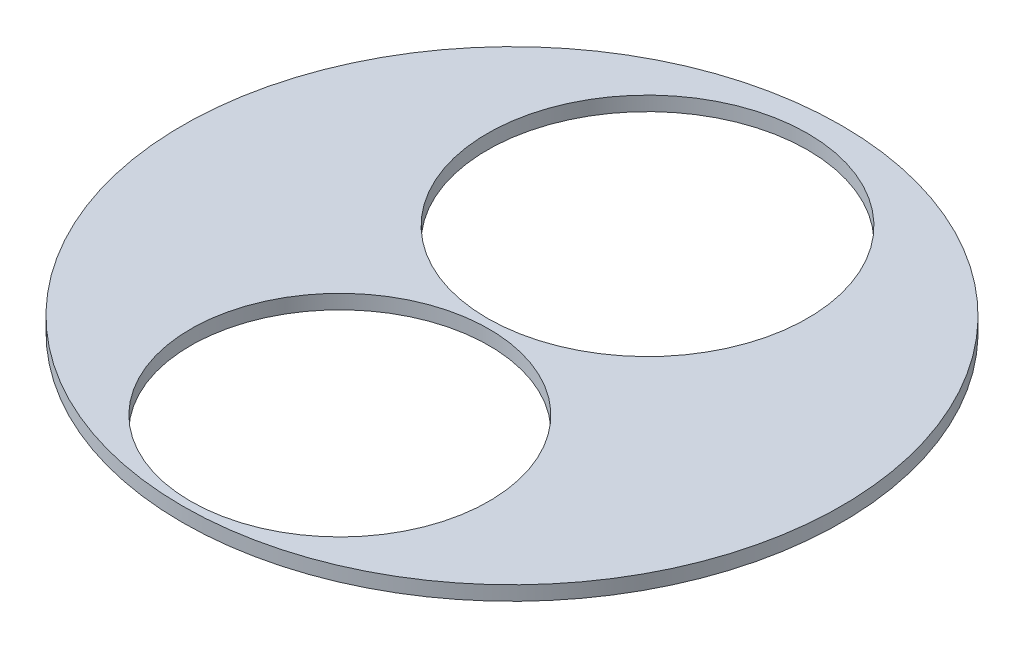
ISO-10303-21;
HEADER;
FILE_DESCRIPTION(('STEP AP214'),'2;1');
FILE_NAME('part.step','',(''),(''),'','','');
FILE_SCHEMA(('AUTOMOTIVE_DESIGN { 1 0 10303 214 1 1 1 1 }'));
ENDSEC;
DATA;
#1=APPLICATION_CONTEXT('core data for automotive mechanical design processes');
#2=APPLICATION_PROTOCOL_DEFINITION('international standard','automotive_design',2000,#1);
#3=PRODUCT_CONTEXT('',#1,'mechanical');
#4=PRODUCT('Part','Part','',(#3));
#5=PRODUCT_RELATED_PRODUCT_CATEGORY('part','',(#4));
#6=PRODUCT_DEFINITION_FORMATION('','',#4);
#7=PRODUCT_DEFINITION_CONTEXT('part definition',#1,'design');
#8=PRODUCT_DEFINITION('design','',#6,#7);
#9=PRODUCT_DEFINITION_SHAPE('','',#8);
#10=(LENGTH_UNIT() NAMED_UNIT(*) SI_UNIT(.MILLI.,.METRE.));
#11=(NAMED_UNIT(*) PLANE_ANGLE_UNIT() SI_UNIT($,.RADIAN.));
#12=(NAMED_UNIT(*) SI_UNIT($,.STERADIAN.) SOLID_ANGLE_UNIT());
#13=UNCERTAINTY_MEASURE_WITH_UNIT(LENGTH_MEASURE(1.E-05),#10,'distance_accuracy_value','');
#14=(GEOMETRIC_REPRESENTATION_CONTEXT(3) GLOBAL_UNCERTAINTY_ASSIGNED_CONTEXT((#13)) GLOBAL_UNIT_ASSIGNED_CONTEXT((#10,
#11,#12)) REPRESENTATION_CONTEXT('',''));
#15=CARTESIAN_POINT('',(0.,0.,0.));
#16=DIRECTION('',(0.,0.,1.));
#17=DIRECTION('',(1.,0.,0.));
#18=AXIS2_PLACEMENT_3D('',#15,#16,#17);
#19=CARTESIAN_POINT('',(0.,50.,0.));
#20=DIRECTION('',(0.,1.,0.));
#21=DIRECTION('',(0.,0.,1.));
#22=AXIS2_PLACEMENT_3D('',#19,#20,#21);
#23=PLANE('',#22);
#24=CARTESIAN_POINT('',(-35.2158294782896,50.,-508.071242416975));
#25=DIRECTION('',(0.,1.,0.));
#26=DIRECTION('',(0.,0.,1.));
#27=AXIS2_PLACEMENT_3D('',#24,#25,#26);
#28=CIRCLE('',#27,558.8);
#29=CARTESIAN_POINT('',(-35.2158294782896,50.,50.7287575830254));
#30=VERTEX_POINT('',#29);
#31=EDGE_CURVE('E54',#30,#30,#28,.T.);
#32=ORIENTED_EDGE('',*,*,#31,.F.);
#33=EDGE_LOOP('',(#32));
#34=FACE_BOUND('',#33,.T.);
#35=CARTESIAN_POINT('',(0.,50.,0.));
#36=DIRECTION('',(0.,1.,0.));
#37=DIRECTION('',(0.,0.,1.));
#38=AXIS2_PLACEMENT_3D('',#35,#36,#37);
#39=CIRCLE('',#38,1149.985);
#40=CARTESIAN_POINT('',(0.,50.,1149.985));
#41=VERTEX_POINT('',#40);
#42=EDGE_CURVE('E10',#41,#41,#39,.T.);
#43=ORIENTED_EDGE('',*,*,#42,.T.);
#44=EDGE_LOOP('',(#43));
#45=FACE_BOUND('',#44,.T.);
#46=CARTESIAN_POINT('',(0.,50.,600.758907486764));
#47=DIRECTION('',(0.,1.,0.));
#48=DIRECTION('',(0.,0.,1.));
#49=AXIS2_PLACEMENT_3D('',#46,#47,#48);
#50=CIRCLE('',#49,520.7);
#51=CARTESIAN_POINT('',(0.,50.,1121.45890748676));
#52=VERTEX_POINT('',#51);
#53=EDGE_CURVE('E60',#52,#52,#50,.T.);
#54=ORIENTED_EDGE('',*,*,#53,.F.);
#55=EDGE_LOOP('',(#54));
#56=FACE_BOUND('',#55,.T.);
#57=ADVANCED_FACE('F41',(#34,#45,#56),#23,.T.);
#58=CARTESIAN_POINT('',(0.,0.,0.));
#59=DIRECTION('',(0.,1.,0.));
#60=DIRECTION('',(0.,0.,1.));
#61=AXIS2_PLACEMENT_3D('',#58,#59,#60);
#62=PLANE('',#61);
#63=CARTESIAN_POINT('',(0.,0.,0.));
#64=DIRECTION('',(0.,1.,0.));
#65=DIRECTION('',(0.,0.,1.));
#66=AXIS2_PLACEMENT_3D('',#63,#64,#65);
#67=CIRCLE('',#66,1149.985);
#68=CARTESIAN_POINT('',(0.,0.,1149.985));
#69=VERTEX_POINT('',#68);
#70=EDGE_CURVE('E45',#69,#69,#67,.T.);
#71=ORIENTED_EDGE('',*,*,#70,.F.);
#72=EDGE_LOOP('',(#71));
#73=FACE_BOUND('',#72,.T.);
#74=CARTESIAN_POINT('',(-35.2158294782896,0.,-508.071242416975));
#75=DIRECTION('',(0.,1.,0.));
#76=DIRECTION('',(0.,0.,1.));
#77=AXIS2_PLACEMENT_3D('',#74,#75,#76);
#78=CIRCLE('',#77,558.8);
#79=CARTESIAN_POINT('',(-35.2158294782896,0.,50.7287575830254));
#80=VERTEX_POINT('',#79);
#81=EDGE_CURVE('E56',#80,#80,#78,.T.);
#82=ORIENTED_EDGE('',*,*,#81,.T.);
#83=EDGE_LOOP('',(#82));
#84=FACE_BOUND('',#83,.T.);
#85=CARTESIAN_POINT('',(0.,0.,600.758907486764));
#86=DIRECTION('',(0.,1.,0.));
#87=DIRECTION('',(0.,0.,1.));
#88=AXIS2_PLACEMENT_3D('',#85,#86,#87);
#89=CIRCLE('',#88,520.7);
#90=CARTESIAN_POINT('',(0.,0.,1121.45890748676));
#91=VERTEX_POINT('',#90);
#92=EDGE_CURVE('E64',#91,#91,#89,.T.);
#93=ORIENTED_EDGE('',*,*,#92,.T.);
#94=EDGE_LOOP('',(#93));
#95=FACE_BOUND('',#94,.T.);
#96=ADVANCED_FACE('F76',(#73,#84,#95),#62,.F.);
#97=CARTESIAN_POINT('',(0.,50.,0.));
#98=DIRECTION('',(0.,-1.,0.));
#99=DIRECTION('',(0.,0.,-1.));
#100=AXIS2_PLACEMENT_3D('',#97,#98,#99);
#101=CYLINDRICAL_SURFACE('',#100,1149.985);
#102=ORIENTED_EDGE('',*,*,#42,.F.);
#103=EDGE_LOOP('',(#102));
#104=FACE_BOUND('',#103,.T.);
#105=ORIENTED_EDGE('',*,*,#70,.T.);
#106=EDGE_LOOP('',(#105));
#107=FACE_BOUND('',#106,.T.);
#108=ADVANCED_FACE('F43',(#104,#107),#101,.T.);
#109=CARTESIAN_POINT('',(-35.2158294782896,50.,-508.071242416975));
#110=DIRECTION('',(0.,-1.,0.));
#111=DIRECTION('',(0.,0.,-1.));
#112=AXIS2_PLACEMENT_3D('',#109,#110,#111);
#113=CYLINDRICAL_SURFACE('',#112,558.8);
#114=ORIENTED_EDGE('',*,*,#31,.T.);
#115=EDGE_LOOP('',(#114));
#116=FACE_BOUND('',#115,.T.);
#117=ORIENTED_EDGE('',*,*,#81,.F.);
#118=EDGE_LOOP('',(#117));
#119=FACE_BOUND('',#118,.T.);
#120=ADVANCED_FACE('F85',(#116,#119),#113,.F.);
#121=CARTESIAN_POINT('',(0.,50.,600.758907486764));
#122=DIRECTION('',(0.,-1.,0.));
#123=DIRECTION('',(0.,0.,-1.));
#124=AXIS2_PLACEMENT_3D('',#121,#122,#123);
#125=CYLINDRICAL_SURFACE('',#124,520.7);
#126=ORIENTED_EDGE('',*,*,#53,.T.);
#127=EDGE_LOOP('',(#126));
#128=FACE_BOUND('',#127,.T.);
#129=ORIENTED_EDGE('',*,*,#92,.F.);
#130=EDGE_LOOP('',(#129));
#131=FACE_BOUND('',#130,.T.);
#132=ADVANCED_FACE('F72',(#128,#131),#125,.F.);
#133=CLOSED_SHELL('',(#57,#96,#108,#120,#132));
#134=MANIFOLD_SOLID_BREP('B2',#133);
#135=ADVANCED_BREP_SHAPE_REPRESENTATION('',(#18,#134),#14);
#136=SHAPE_DEFINITION_REPRESENTATION(#9,#135);
ENDSEC;
END-ISO-10303-21;
